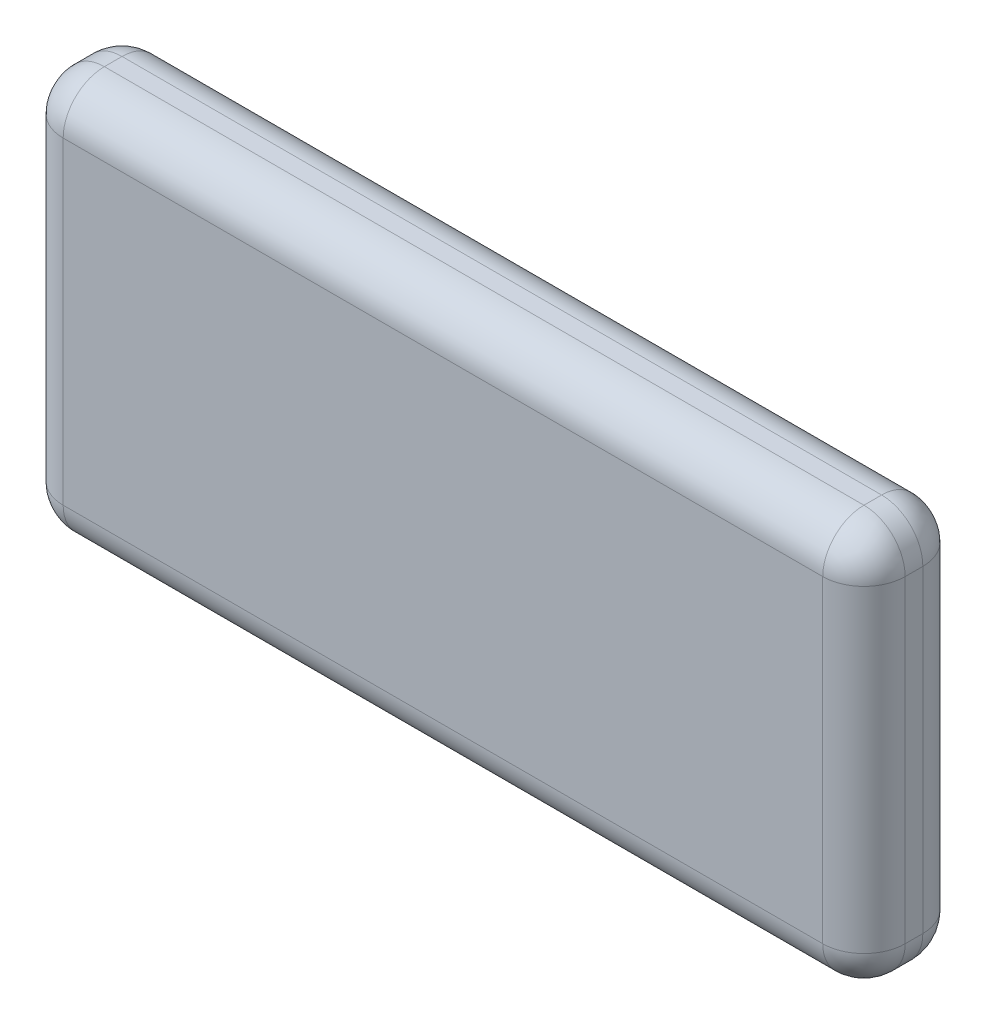
ISO-10303-21;
HEADER;
FILE_DESCRIPTION(('STEP AP214'),'2;1');
FILE_NAME('part.step','',(''),(''),'','','');
FILE_SCHEMA(('AUTOMOTIVE_DESIGN { 1 0 10303 214 1 1 1 1 }'));
ENDSEC;
DATA;
#1=APPLICATION_CONTEXT('core data for automotive mechanical design processes');
#2=APPLICATION_PROTOCOL_DEFINITION('international standard','automotive_design',2000,#1);
#3=PRODUCT_CONTEXT('',#1,'mechanical');
#4=PRODUCT('Part','Part','',(#3));
#5=PRODUCT_RELATED_PRODUCT_CATEGORY('part','',(#4));
#6=PRODUCT_DEFINITION_FORMATION('','',#4);
#7=PRODUCT_DEFINITION_CONTEXT('part definition',#1,'design');
#8=PRODUCT_DEFINITION('design','',#6,#7);
#9=PRODUCT_DEFINITION_SHAPE('','',#8);
#10=(LENGTH_UNIT() NAMED_UNIT(*) SI_UNIT(.MILLI.,.METRE.));
#11=(NAMED_UNIT(*) PLANE_ANGLE_UNIT() SI_UNIT($,.RADIAN.));
#12=(NAMED_UNIT(*) SI_UNIT($,.STERADIAN.) SOLID_ANGLE_UNIT());
#13=UNCERTAINTY_MEASURE_WITH_UNIT(LENGTH_MEASURE(1.E-05),#10,'distance_accuracy_value','');
#14=(GEOMETRIC_REPRESENTATION_CONTEXT(3) GLOBAL_UNCERTAINTY_ASSIGNED_CONTEXT((#13)) GLOBAL_UNIT_ASSIGNED_CONTEXT((#10,
#11,#12)) REPRESENTATION_CONTEXT('',''));
#15=CARTESIAN_POINT('',(0.,0.,0.));
#16=DIRECTION('',(0.,0.,1.));
#17=DIRECTION('',(1.,0.,0.));
#18=AXIS2_PLACEMENT_3D('',#15,#16,#17);
#19=CARTESIAN_POINT('',(-137.203539823009,47.6902654867257,17.));
#20=DIRECTION('',(1.,0.,0.));
#21=DIRECTION('',(0.,0.,-1.));
#22=AXIS2_PLACEMENT_3D('',#19,#20,#21);
#23=PLANE('',#22);
#24=DIRECTION('',(0.,-1.,0.));
#25=VECTOR('',#24,1.);
#26=CARTESIAN_POINT('',(-137.203539823009,47.6902654867257,7.));
#27=LINE('',#26,#25);
#28=CARTESIAN_POINT('',(-137.203539823009,40.6902654867257,7.));
#29=VERTEX_POINT('',#28);
#30=CARTESIAN_POINT('',(-137.203539823009,-13.3097345132743,7.));
#31=VERTEX_POINT('',#30);
#32=EDGE_CURVE('E209',#29,#31,#27,.T.);
#33=ORIENTED_EDGE('',*,*,#32,.T.);
#34=DIRECTION('',(0.,0.,-1.));
#35=VECTOR('',#34,1.);
#36=CARTESIAN_POINT('',(-137.203539823009,-13.3097345132743,17.));
#37=LINE('',#36,#35);
#38=CARTESIAN_POINT('',(-137.203539823009,-13.3097345132743,10.));
#39=VERTEX_POINT('',#38);
#40=EDGE_CURVE('E289',#31,#39,#37,.F.);
#41=ORIENTED_EDGE('',*,*,#40,.T.);
#42=DIRECTION('',(0.,-1.,0.));
#43=VECTOR('',#42,1.);
#44=CARTESIAN_POINT('',(-137.203539823009,47.6902654867257,10.));
#45=LINE('',#44,#43);
#46=CARTESIAN_POINT('',(-137.203539823009,40.6902654867257,10.));
#47=VERTEX_POINT('',#46);
#48=EDGE_CURVE('E216',#39,#47,#45,.F.);
#49=ORIENTED_EDGE('',*,*,#48,.T.);
#50=DIRECTION('',(0.,0.,-1.));
#51=VECTOR('',#50,1.);
#52=CARTESIAN_POINT('',(-137.203539823009,40.6902654867257,17.));
#53=LINE('',#52,#51);
#54=EDGE_CURVE('E213',#47,#29,#53,.T.);
#55=ORIENTED_EDGE('',*,*,#54,.T.);
#56=EDGE_LOOP('',(#33,#41,#49,#55));
#57=FACE_BOUND('',#56,.T.);
#58=ADVANCED_FACE('F47',(#57),#23,.F.);
#59=CARTESIAN_POINT('',(-137.203539823009,-20.3097345132743,17.));
#60=DIRECTION('',(0.,1.,0.));
#61=DIRECTION('',(0.,0.,1.));
#62=AXIS2_PLACEMENT_3D('',#59,#60,#61);
#63=PLANE('',#62);
#64=DIRECTION('',(1.,0.,0.));
#65=VECTOR('',#64,1.);
#66=CARTESIAN_POINT('',(-137.203539823009,-20.3097345132743,10.));
#67=LINE('',#66,#65);
#68=CARTESIAN_POINT('',(-1.20353982300886,-20.3097345132743,10.));
#69=VERTEX_POINT('',#68);
#70=CARTESIAN_POINT('',(-130.203539823009,-20.3097345132743,10.));
#71=VERTEX_POINT('',#70);
#72=EDGE_CURVE('E238',#69,#71,#67,.F.);
#73=ORIENTED_EDGE('',*,*,#72,.T.);
#74=DIRECTION('',(0.,0.,-1.));
#75=VECTOR('',#74,1.);
#76=CARTESIAN_POINT('',(-130.203539823009,-20.3097345132743,17.));
#77=LINE('',#76,#75);
#78=CARTESIAN_POINT('',(-130.203539823009,-20.3097345132743,7.));
#79=VERTEX_POINT('',#78);
#80=EDGE_CURVE('E286',#71,#79,#77,.T.);
#81=ORIENTED_EDGE('',*,*,#80,.T.);
#82=DIRECTION('',(1.,0.,0.));
#83=VECTOR('',#82,1.);
#84=CARTESIAN_POINT('',(-137.203539823009,-20.3097345132743,7.));
#85=LINE('',#84,#83);
#86=CARTESIAN_POINT('',(-1.20353982300886,-20.3097345132743,7.));
#87=VERTEX_POINT('',#86);
#88=EDGE_CURVE('E234',#79,#87,#85,.T.);
#89=ORIENTED_EDGE('',*,*,#88,.T.);
#90=DIRECTION('',(0.,0.,-1.));
#91=VECTOR('',#90,1.);
#92=CARTESIAN_POINT('',(-1.20353982300886,-20.3097345132743,17.));
#93=LINE('',#92,#91);
#94=EDGE_CURVE('E283',#87,#69,#93,.F.);
#95=ORIENTED_EDGE('',*,*,#94,.T.);
#96=EDGE_LOOP('',(#73,#81,#89,#95));
#97=FACE_BOUND('',#96,.T.);
#98=ADVANCED_FACE('F357',(#97),#63,.F.);
#99=CARTESIAN_POINT('',(5.79646017699115,47.6902654867257,17.));
#100=DIRECTION('',(-1.,0.,0.));
#101=DIRECTION('',(0.,0.,1.));
#102=AXIS2_PLACEMENT_3D('',#99,#100,#101);
#103=PLANE('',#102);
#104=DIRECTION('',(0.,1.,0.));
#105=VECTOR('',#104,1.);
#106=CARTESIAN_POINT('',(5.79646017699115,-20.3097345132743,10.));
#107=LINE('',#106,#105);
#108=CARTESIAN_POINT('',(5.79646017699115,40.6902654867257,10.));
#109=VERTEX_POINT('',#108);
#110=CARTESIAN_POINT('',(5.79646017699115,-13.3097345132743,10.));
#111=VERTEX_POINT('',#110);
#112=EDGE_CURVE('E191',#109,#111,#107,.F.);
#113=ORIENTED_EDGE('',*,*,#112,.T.);
#114=DIRECTION('',(0.,0.,-1.));
#115=VECTOR('',#114,1.);
#116=CARTESIAN_POINT('',(5.79646017699115,-13.3097345132743,17.));
#117=LINE('',#116,#115);
#118=CARTESIAN_POINT('',(5.79646017699115,-13.3097345132743,7.));
#119=VERTEX_POINT('',#118);
#120=EDGE_CURVE('E65',#111,#119,#117,.T.);
#121=ORIENTED_EDGE('',*,*,#120,.T.);
#122=DIRECTION('',(0.,1.,0.));
#123=VECTOR('',#122,1.);
#124=CARTESIAN_POINT('',(5.79646017699115,47.6902654867257,7.));
#125=LINE('',#124,#123);
#126=CARTESIAN_POINT('',(5.79646017699115,40.6902654867257,7.));
#127=VERTEX_POINT('',#126);
#128=EDGE_CURVE('E181',#119,#127,#125,.T.);
#129=ORIENTED_EDGE('',*,*,#128,.T.);
#130=DIRECTION('',(0.,0.,-1.));
#131=VECTOR('',#130,1.);
#132=CARTESIAN_POINT('',(5.79646017699115,40.6902654867257,17.));
#133=LINE('',#132,#131);
#134=EDGE_CURVE('E147',#127,#109,#133,.F.);
#135=ORIENTED_EDGE('',*,*,#134,.T.);
#136=EDGE_LOOP('',(#113,#121,#129,#135));
#137=FACE_BOUND('',#136,.T.);
#138=ADVANCED_FACE('F359',(#137),#103,.F.);
#139=CARTESIAN_POINT('',(-137.203539823009,47.6902654867257,17.));
#140=DIRECTION('',(0.,-1.,0.));
#141=DIRECTION('',(1.,0.,0.));
#142=AXIS2_PLACEMENT_3D('',#139,#140,#141);
#143=PLANE('',#142);
#144=DIRECTION('',(-1.,0.,0.));
#145=VECTOR('',#144,1.);
#146=CARTESIAN_POINT('',(5.79646017699115,47.6902654867257,10.));
#147=LINE('',#146,#145);
#148=CARTESIAN_POINT('',(-130.203539823009,47.6902654867257,10.));
#149=VERTEX_POINT('',#148);
#150=CARTESIAN_POINT('',(-1.20353982300886,47.6902654867257,10.));
#151=VERTEX_POINT('',#150);
#152=EDGE_CURVE('E178',#149,#151,#147,.F.);
#153=ORIENTED_EDGE('',*,*,#152,.T.);
#154=DIRECTION('',(0.,0.,-1.));
#155=VECTOR('',#154,1.);
#156=CARTESIAN_POINT('',(-1.20353982300886,47.6902654867257,17.));
#157=LINE('',#156,#155);
#158=CARTESIAN_POINT('',(-1.20353982300886,47.6902654867257,7.));
#159=VERTEX_POINT('',#158);
#160=EDGE_CURVE('E145',#151,#159,#157,.T.);
#161=ORIENTED_EDGE('',*,*,#160,.T.);
#162=DIRECTION('',(-1.,0.,0.));
#163=VECTOR('',#162,1.);
#164=CARTESIAN_POINT('',(-137.203539823009,47.6902654867257,7.));
#165=LINE('',#164,#163);
#166=CARTESIAN_POINT('',(-130.203539823009,47.6902654867257,7.));
#167=VERTEX_POINT('',#166);
#168=EDGE_CURVE('E166',#159,#167,#165,.T.);
#169=ORIENTED_EDGE('',*,*,#168,.T.);
#170=DIRECTION('',(0.,0.,-1.));
#171=VECTOR('',#170,1.);
#172=CARTESIAN_POINT('',(-130.203539823009,47.6902654867257,17.));
#173=LINE('',#172,#171);
#174=EDGE_CURVE('E173',#167,#149,#173,.F.);
#175=ORIENTED_EDGE('',*,*,#174,.T.);
#176=EDGE_LOOP('',(#153,#161,#169,#175));
#177=FACE_BOUND('',#176,.T.);
#178=ADVANCED_FACE('F176',(#177),#143,.F.);
#179=CARTESIAN_POINT('',(0.,0.,17.));
#180=DIRECTION('',(0.,0.,1.));
#181=DIRECTION('',(1.,0.,0.));
#182=AXIS2_PLACEMENT_3D('',#179,#180,#181);
#183=PLANE('',#182);
#184=DIRECTION('',(0.,1.,0.));
#185=VECTOR('',#184,1.);
#186=CARTESIAN_POINT('',(-1.20353982300885,47.6902654867257,17.));
#187=LINE('',#186,#185);
#188=CARTESIAN_POINT('',(-1.20353982300885,-13.3097345132743,17.));
#189=VERTEX_POINT('',#188);
#190=CARTESIAN_POINT('',(-1.20353982300885,40.6902654867257,17.));
#191=VERTEX_POINT('',#190);
#192=EDGE_CURVE('E202',#189,#191,#187,.T.);
#193=ORIENTED_EDGE('',*,*,#192,.T.);
#194=DIRECTION('',(-1.,0.,0.));
#195=VECTOR('',#194,1.);
#196=CARTESIAN_POINT('',(-137.203539823009,40.6902654867257,17.));
#197=LINE('',#196,#195);
#198=CARTESIAN_POINT('',(-130.203539823009,40.6902654867257,17.));
#199=VERTEX_POINT('',#198);
#200=EDGE_CURVE('E205',#191,#199,#197,.T.);
#201=ORIENTED_EDGE('',*,*,#200,.T.);
#202=DIRECTION('',(0.,-1.,0.));
#203=VECTOR('',#202,1.);
#204=CARTESIAN_POINT('',(-130.203539823009,-20.3097345132743,17.));
#205=LINE('',#204,#203);
#206=CARTESIAN_POINT('',(-130.203539823009,-13.3097345132743,17.));
#207=VERTEX_POINT('',#206);
#208=EDGE_CURVE('E198',#199,#207,#205,.T.);
#209=ORIENTED_EDGE('',*,*,#208,.T.);
#210=DIRECTION('',(1.,0.,0.));
#211=VECTOR('',#210,1.);
#212=CARTESIAN_POINT('',(5.79646017699115,-13.3097345132743,17.));
#213=LINE('',#212,#211);
#214=EDGE_CURVE('E194',#207,#189,#213,.T.);
#215=ORIENTED_EDGE('',*,*,#214,.T.);
#216=EDGE_LOOP('',(#193,#201,#209,#215));
#217=FACE_BOUND('',#216,.T.);
#218=ADVANCED_FACE('F484',(#217),#183,.T.);
#219=CARTESIAN_POINT('',(0.,0.,0.));
#220=DIRECTION('',(0.,0.,1.));
#221=DIRECTION('',(1.,0.,0.));
#222=AXIS2_PLACEMENT_3D('',#219,#220,#221);
#223=PLANE('',#222);
#224=DIRECTION('',(0.,-1.,0.));
#225=VECTOR('',#224,1.);
#226=CARTESIAN_POINT('',(-130.203539823009,0.,0.));
#227=LINE('',#226,#225);
#228=CARTESIAN_POINT('',(-130.203539823009,-13.3097345132743,0.));
#229=VERTEX_POINT('',#228);
#230=CARTESIAN_POINT('',(-130.203539823009,40.6902654867257,0.));
#231=VERTEX_POINT('',#230);
#232=EDGE_CURVE('E223',#229,#231,#227,.F.);
#233=ORIENTED_EDGE('',*,*,#232,.T.);
#234=DIRECTION('',(-1.,0.,0.));
#235=VECTOR('',#234,1.);
#236=CARTESIAN_POINT('',(0.,40.6902654867257,0.));
#237=LINE('',#236,#235);
#238=CARTESIAN_POINT('',(-1.20353982300885,40.6902654867257,0.));
#239=VERTEX_POINT('',#238);
#240=EDGE_CURVE('E230',#231,#239,#237,.F.);
#241=ORIENTED_EDGE('',*,*,#240,.T.);
#242=DIRECTION('',(0.,1.,0.));
#243=VECTOR('',#242,1.);
#244=CARTESIAN_POINT('',(-1.20353982300885,0.,0.));
#245=LINE('',#244,#243);
#246=CARTESIAN_POINT('',(-1.20353982300885,-13.3097345132743,0.));
#247=VERTEX_POINT('',#246);
#248=EDGE_CURVE('E226',#239,#247,#245,.F.);
#249=ORIENTED_EDGE('',*,*,#248,.T.);
#250=DIRECTION('',(1.,0.,0.));
#251=VECTOR('',#250,1.);
#252=CARTESIAN_POINT('',(0.,-13.3097345132743,0.));
#253=LINE('',#252,#251);
#254=EDGE_CURVE('E219',#247,#229,#253,.F.);
#255=ORIENTED_EDGE('',*,*,#254,.T.);
#256=EDGE_LOOP('',(#233,#241,#249,#255));
#257=FACE_BOUND('',#256,.T.);
#258=ADVANCED_FACE('F325',(#257),#223,.F.);
#259=CARTESIAN_POINT('',(-130.203539823009,0.,10.));
#260=DIRECTION('',(0.,1.,0.));
#261=DIRECTION('',(0.,0.,1.));
#262=AXIS2_PLACEMENT_3D('',#259,#260,#261);
#263=CYLINDRICAL_SURFACE('',#262,7.);
#264=ORIENTED_EDGE('',*,*,#48,.F.);
#265=CARTESIAN_POINT('',(-130.203539823009,-13.3097345132743,10.));
#266=DIRECTION('',(0.,1.,0.));
#267=DIRECTION('',(0.,0.,1.));
#268=AXIS2_PLACEMENT_3D('',#265,#266,#267);
#269=CIRCLE('',#268,7.);
#270=EDGE_CURVE('E280',#39,#207,#269,.T.);
#271=ORIENTED_EDGE('',*,*,#270,.T.);
#272=ORIENTED_EDGE('',*,*,#208,.F.);
#273=CARTESIAN_POINT('',(-130.203539823009,40.6902654867257,10.));
#274=DIRECTION('',(0.,1.,0.));
#275=DIRECTION('',(0.,0.,1.));
#276=AXIS2_PLACEMENT_3D('',#273,#274,#275);
#277=CIRCLE('',#276,7.);
#278=EDGE_CURVE('E174',#47,#199,#277,.T.);
#279=ORIENTED_EDGE('',*,*,#278,.F.);
#280=EDGE_LOOP('',(#264,#271,#272,#279));
#281=FACE_BOUND('',#280,.T.);
#282=ADVANCED_FACE('F347',(#281),#263,.T.);
#283=CARTESIAN_POINT('',(-130.203539823009,40.6902654867257,17.));
#284=DIRECTION('',(0.,0.,-1.));
#285=DIRECTION('',(-1.,0.,0.));
#286=AXIS2_PLACEMENT_3D('',#283,#284,#285);
#287=CYLINDRICAL_SURFACE('',#286,7.);
#288=CARTESIAN_POINT('',(-130.203539823009,40.6902654867257,7.));
#289=DIRECTION('',(0.,0.,-1.));
#290=DIRECTION('',(-1.,0.,0.));
#291=AXIS2_PLACEMENT_3D('',#288,#289,#290);
#292=CIRCLE('',#291,7.);
#293=EDGE_CURVE('E263',#29,#167,#292,.T.);
#294=ORIENTED_EDGE('',*,*,#293,.F.);
#295=ORIENTED_EDGE('',*,*,#54,.F.);
#296=CARTESIAN_POINT('',(-130.203539823009,40.6902654867257,10.));
#297=DIRECTION('',(0.,0.,1.));
#298=DIRECTION('',(1.,0.,0.));
#299=AXIS2_PLACEMENT_3D('',#296,#297,#298);
#300=CIRCLE('',#299,7.);
#301=EDGE_CURVE('E267',#149,#47,#300,.T.);
#302=ORIENTED_EDGE('',*,*,#301,.F.);
#303=ORIENTED_EDGE('',*,*,#174,.F.);
#304=EDGE_LOOP('',(#294,#295,#302,#303));
#305=FACE_BOUND('',#304,.T.);
#306=ADVANCED_FACE('F404',(#305),#287,.T.);
#307=CARTESIAN_POINT('',(-130.203539823009,47.6902654867257,7.));
#308=DIRECTION('',(0.,-1.,0.));
#309=DIRECTION('',(0.,0.,-1.));
#310=AXIS2_PLACEMENT_3D('',#307,#308,#309);
#311=CYLINDRICAL_SURFACE('',#310,7.);
#312=ORIENTED_EDGE('',*,*,#232,.F.);
#313=CARTESIAN_POINT('',(-130.203539823009,-13.3097345132743,7.));
#314=DIRECTION('',(0.,-1.,0.));
#315=DIRECTION('',(0.,0.,-1.));
#316=AXIS2_PLACEMENT_3D('',#313,#314,#315);
#317=CIRCLE('',#316,7.);
#318=EDGE_CURVE('E57',#229,#31,#317,.F.);
#319=ORIENTED_EDGE('',*,*,#318,.T.);
#320=ORIENTED_EDGE('',*,*,#32,.F.);
#321=CARTESIAN_POINT('',(-130.203539823009,40.6902654867257,7.));
#322=DIRECTION('',(0.,1.,0.));
#323=DIRECTION('',(0.,0.,1.));
#324=AXIS2_PLACEMENT_3D('',#321,#322,#323);
#325=CIRCLE('',#324,7.);
#326=EDGE_CURVE('E259',#231,#29,#325,.T.);
#327=ORIENTED_EDGE('',*,*,#326,.F.);
#328=EDGE_LOOP('',(#312,#319,#320,#327));
#329=FACE_BOUND('',#328,.T.);
#330=ADVANCED_FACE('F401',(#329),#311,.T.);
#331=CARTESIAN_POINT('',(0.,-13.3097345132743,10.));
#332=DIRECTION('',(-1.,0.,0.));
#333=DIRECTION('',(0.,0.,1.));
#334=AXIS2_PLACEMENT_3D('',#331,#332,#333);
#335=CYLINDRICAL_SURFACE('',#334,7.);
#336=ORIENTED_EDGE('',*,*,#214,.F.);
#337=CARTESIAN_POINT('',(-130.203539823009,-13.3097345132743,10.));
#338=DIRECTION('',(-1.,0.,0.));
#339=DIRECTION('',(0.,0.,1.));
#340=AXIS2_PLACEMENT_3D('',#337,#338,#339);
#341=CIRCLE('',#340,7.);
#342=EDGE_CURVE('E276',#207,#71,#341,.F.);
#343=ORIENTED_EDGE('',*,*,#342,.T.);
#344=ORIENTED_EDGE('',*,*,#72,.F.);
#345=CARTESIAN_POINT('',(-1.20353982300885,-13.3097345132743,10.));
#346=DIRECTION('',(-1.,0.,0.));
#347=DIRECTION('',(0.,0.,1.));
#348=AXIS2_PLACEMENT_3D('',#345,#346,#347);
#349=CIRCLE('',#348,7.);
#350=EDGE_CURVE('E241',#69,#189,#349,.T.);
#351=ORIENTED_EDGE('',*,*,#350,.T.);
#352=EDGE_LOOP('',(#336,#343,#344,#351));
#353=FACE_BOUND('',#352,.T.);
#354=ADVANCED_FACE('F355',(#353),#335,.T.);
#355=CARTESIAN_POINT('',(-130.203539823009,40.6902654867257,10.));
#356=DIRECTION('',(-1.,0.,0.));
#357=DIRECTION('',(0.,0.,1.));
#358=AXIS2_PLACEMENT_3D('',#355,#356,#357);
#359=SPHERICAL_SURFACE('',#358,7.);
#360=ORIENTED_EDGE('',*,*,#301,.T.);
#361=ORIENTED_EDGE('',*,*,#278,.T.);
#362=CARTESIAN_POINT('',(-130.203539823009,40.6902654867257,10.));
#363=DIRECTION('',(-1.,0.,0.));
#364=DIRECTION('',(0.,0.,1.));
#365=AXIS2_PLACEMENT_3D('',#362,#363,#364);
#366=CIRCLE('',#365,7.);
#367=EDGE_CURVE('E256',#149,#199,#366,.F.);
#368=ORIENTED_EDGE('',*,*,#367,.F.);
#369=EDGE_LOOP('',(#360,#361,#368));
#370=FACE_BOUND('',#369,.T.);
#371=ADVANCED_FACE('F394',(#370),#359,.T.);
#372=CARTESIAN_POINT('',(-130.203539823009,40.6902654867257,7.));
#373=DIRECTION('',(-1.,0.,0.));
#374=DIRECTION('',(0.,0.,1.));
#375=AXIS2_PLACEMENT_3D('',#372,#373,#374);
#376=SPHERICAL_SURFACE('',#375,7.);
#377=ORIENTED_EDGE('',*,*,#326,.T.);
#378=ORIENTED_EDGE('',*,*,#293,.T.);
#379=CARTESIAN_POINT('',(-130.203539823009,40.6902654867257,7.));
#380=DIRECTION('',(-1.,0.,0.));
#381=DIRECTION('',(0.,0.,1.));
#382=AXIS2_PLACEMENT_3D('',#379,#380,#381);
#383=CIRCLE('',#382,7.);
#384=EDGE_CURVE('E169',#231,#167,#383,.F.);
#385=ORIENTED_EDGE('',*,*,#384,.F.);
#386=EDGE_LOOP('',(#377,#378,#385));
#387=FACE_BOUND('',#386,.T.);
#388=ADVANCED_FACE('F391',(#387),#376,.T.);
#389=CARTESIAN_POINT('',(-137.203539823009,-13.3097345132743,7.));
#390=DIRECTION('',(1.,0.,0.));
#391=DIRECTION('',(0.,0.,-1.));
#392=AXIS2_PLACEMENT_3D('',#389,#390,#391);
#393=CYLINDRICAL_SURFACE('',#392,7.);
#394=ORIENTED_EDGE('',*,*,#88,.F.);
#395=CARTESIAN_POINT('',(-130.203539823009,-13.3097345132743,7.));
#396=DIRECTION('',(1.,0.,0.));
#397=DIRECTION('',(0.,0.,-1.));
#398=AXIS2_PLACEMENT_3D('',#395,#396,#397);
#399=CIRCLE('',#398,7.);
#400=EDGE_CURVE('E301',#79,#229,#399,.T.);
#401=ORIENTED_EDGE('',*,*,#400,.T.);
#402=ORIENTED_EDGE('',*,*,#254,.F.);
#403=CARTESIAN_POINT('',(-1.20353982300886,-13.3097345132743,7.));
#404=DIRECTION('',(1.,0.,0.));
#405=DIRECTION('',(0.,0.,-1.));
#406=AXIS2_PLACEMENT_3D('',#403,#404,#405);
#407=CIRCLE('',#406,7.);
#408=EDGE_CURVE('E298',#247,#87,#407,.F.);
#409=ORIENTED_EDGE('',*,*,#408,.T.);
#410=EDGE_LOOP('',(#394,#401,#402,#409));
#411=FACE_BOUND('',#410,.T.);
#412=ADVANCED_FACE('F329',(#411),#393,.T.);
#413=CARTESIAN_POINT('',(-1.20353982300885,0.,10.));
#414=DIRECTION('',(0.,-1.,0.));
#415=DIRECTION('',(0.,0.,-1.));
#416=AXIS2_PLACEMENT_3D('',#413,#414,#415);
#417=CYLINDRICAL_SURFACE('',#416,7.);
#418=ORIENTED_EDGE('',*,*,#192,.F.);
#419=CARTESIAN_POINT('',(-1.20353982300885,-13.3097345132743,10.));
#420=DIRECTION('',(0.,-1.,0.));
#421=DIRECTION('',(0.,0.,-1.));
#422=AXIS2_PLACEMENT_3D('',#419,#420,#421);
#423=CIRCLE('',#422,7.);
#424=EDGE_CURVE('E292',#189,#111,#423,.F.);
#425=ORIENTED_EDGE('',*,*,#424,.T.);
#426=ORIENTED_EDGE('',*,*,#112,.F.);
#427=CARTESIAN_POINT('',(-1.20353982300885,40.6902654867257,10.));
#428=DIRECTION('',(0.,1.,0.));
#429=DIRECTION('',(0.,0.,1.));
#430=AXIS2_PLACEMENT_3D('',#427,#428,#429);
#431=CIRCLE('',#430,7.);
#432=EDGE_CURVE('E250',#191,#109,#431,.T.);
#433=ORIENTED_EDGE('',*,*,#432,.F.);
#434=EDGE_LOOP('',(#418,#425,#426,#433));
#435=FACE_BOUND('',#434,.T.);
#436=ADVANCED_FACE('F384',(#435),#417,.T.);
#437=CARTESIAN_POINT('',(0.,40.6902654867257,10.));
#438=DIRECTION('',(1.,0.,0.));
#439=DIRECTION('',(0.,1.,0.));
#440=AXIS2_PLACEMENT_3D('',#437,#438,#439);
#441=CYLINDRICAL_SURFACE('',#440,7.);
#442=ORIENTED_EDGE('',*,*,#367,.T.);
#443=ORIENTED_EDGE('',*,*,#200,.F.);
#444=CARTESIAN_POINT('',(-1.20353982300886,40.6902654867257,10.));
#445=DIRECTION('',(1.,0.,0.));
#446=DIRECTION('',(0.,0.,-1.));
#447=AXIS2_PLACEMENT_3D('',#444,#445,#446);
#448=CIRCLE('',#447,7.);
#449=EDGE_CURVE('E163',#151,#191,#448,.T.);
#450=ORIENTED_EDGE('',*,*,#449,.F.);
#451=ORIENTED_EDGE('',*,*,#152,.F.);
#452=EDGE_LOOP('',(#442,#443,#450,#451));
#453=FACE_BOUND('',#452,.T.);
#454=ADVANCED_FACE('F381',(#453),#441,.T.);
#455=CARTESIAN_POINT('',(-137.203539823009,40.6902654867257,7.));
#456=DIRECTION('',(-1.,0.,0.));
#457=DIRECTION('',(0.,-1.,0.));
#458=AXIS2_PLACEMENT_3D('',#455,#456,#457);
#459=CYLINDRICAL_SURFACE('',#458,7.);
#460=ORIENTED_EDGE('',*,*,#384,.T.);
#461=ORIENTED_EDGE('',*,*,#168,.F.);
#462=CARTESIAN_POINT('',(-1.20353982300885,40.6902654867257,7.));
#463=DIRECTION('',(1.,0.,0.));
#464=DIRECTION('',(0.,1.,0.));
#465=AXIS2_PLACEMENT_3D('',#462,#463,#464);
#466=CIRCLE('',#465,7.);
#467=EDGE_CURVE('E154',#239,#159,#466,.T.);
#468=ORIENTED_EDGE('',*,*,#467,.F.);
#469=ORIENTED_EDGE('',*,*,#240,.F.);
#470=EDGE_LOOP('',(#460,#461,#468,#469));
#471=FACE_BOUND('',#470,.T.);
#472=ADVANCED_FACE('F167',(#471),#459,.T.);
#473=CARTESIAN_POINT('',(-1.20353982300885,47.6902654867257,7.));
#474=DIRECTION('',(0.,1.,0.));
#475=DIRECTION('',(0.,0.,1.));
#476=AXIS2_PLACEMENT_3D('',#473,#474,#475);
#477=CYLINDRICAL_SURFACE('',#476,7.);
#478=ORIENTED_EDGE('',*,*,#128,.F.);
#479=CARTESIAN_POINT('',(-1.20353982300885,-13.3097345132743,7.));
#480=DIRECTION('',(0.,1.,0.));
#481=DIRECTION('',(0.,0.,1.));
#482=AXIS2_PLACEMENT_3D('',#479,#480,#481);
#483=CIRCLE('',#482,7.);
#484=EDGE_CURVE('E11',#119,#247,#483,.T.);
#485=ORIENTED_EDGE('',*,*,#484,.T.);
#486=ORIENTED_EDGE('',*,*,#248,.F.);
#487=CARTESIAN_POINT('',(-1.20353982300885,40.6902654867257,7.));
#488=DIRECTION('',(0.,1.,0.));
#489=DIRECTION('',(0.,0.,1.));
#490=AXIS2_PLACEMENT_3D('',#487,#488,#489);
#491=CIRCLE('',#490,7.);
#492=EDGE_CURVE('E158',#127,#239,#491,.T.);
#493=ORIENTED_EDGE('',*,*,#492,.F.);
#494=EDGE_LOOP('',(#478,#485,#486,#493));
#495=FACE_BOUND('',#494,.T.);
#496=ADVANCED_FACE('F322',(#495),#477,.T.);
#497=CARTESIAN_POINT('',(-1.20353982300885,40.6902654867257,10.));
#498=DIRECTION('',(0.,0.,1.));
#499=DIRECTION('',(1.,0.,0.));
#500=AXIS2_PLACEMENT_3D('',#497,#498,#499);
#501=SPHERICAL_SURFACE('',#500,7.);
#502=ORIENTED_EDGE('',*,*,#449,.T.);
#503=ORIENTED_EDGE('',*,*,#432,.T.);
#504=CARTESIAN_POINT('',(-1.20353982300885,40.6902654867257,10.));
#505=DIRECTION('',(0.,0.,1.));
#506=DIRECTION('',(1.,0.,0.));
#507=AXIS2_PLACEMENT_3D('',#504,#505,#506);
#508=CIRCLE('',#507,7.);
#509=EDGE_CURVE('E150',#151,#109,#508,.F.);
#510=ORIENTED_EDGE('',*,*,#509,.F.);
#511=EDGE_LOOP('',(#502,#503,#510));
#512=FACE_BOUND('',#511,.T.);
#513=ADVANCED_FACE('F373',(#512),#501,.T.);
#514=CARTESIAN_POINT('',(-1.20353982300885,40.6902654867257,7.));
#515=DIRECTION('',(0.,0.,-1.));
#516=DIRECTION('',(-1.,0.,0.));
#517=AXIS2_PLACEMENT_3D('',#514,#515,#516);
#518=SPHERICAL_SURFACE('',#517,7.);
#519=ORIENTED_EDGE('',*,*,#492,.T.);
#520=ORIENTED_EDGE('',*,*,#467,.T.);
#521=CARTESIAN_POINT('',(-1.20353982300886,40.6902654867257,7.));
#522=DIRECTION('',(0.,0.,-1.));
#523=DIRECTION('',(-1.,0.,0.));
#524=AXIS2_PLACEMENT_3D('',#521,#522,#523);
#525=CIRCLE('',#524,7.);
#526=EDGE_CURVE('E141',#127,#159,#525,.F.);
#527=ORIENTED_EDGE('',*,*,#526,.F.);
#528=EDGE_LOOP('',(#519,#520,#527));
#529=FACE_BOUND('',#528,.T.);
#530=ADVANCED_FACE('F156',(#529),#518,.T.);
#531=CARTESIAN_POINT('',(-1.20353982300886,40.6902654867257,17.));
#532=DIRECTION('',(0.,0.,-1.));
#533=DIRECTION('',(-1.,0.,0.));
#534=AXIS2_PLACEMENT_3D('',#531,#532,#533);
#535=CYLINDRICAL_SURFACE('',#534,7.);
#536=ORIENTED_EDGE('',*,*,#509,.T.);
#537=ORIENTED_EDGE('',*,*,#134,.F.);
#538=ORIENTED_EDGE('',*,*,#526,.T.);
#539=ORIENTED_EDGE('',*,*,#160,.F.);
#540=EDGE_LOOP('',(#536,#537,#538,#539));
#541=FACE_BOUND('',#540,.T.);
#542=ADVANCED_FACE('F143',(#541),#535,.T.);
#543=CARTESIAN_POINT('',(-130.203539823009,-13.3097345132743,7.));
#544=DIRECTION('',(0.,0.,1.));
#545=DIRECTION('',(1.,0.,0.));
#546=AXIS2_PLACEMENT_3D('',#543,#544,#545);
#547=SPHERICAL_SURFACE('',#546,7.);
#548=ORIENTED_EDGE('',*,*,#318,.F.);
#549=ORIENTED_EDGE('',*,*,#400,.F.);
#550=CARTESIAN_POINT('',(-130.203539823009,-13.3097345132743,7.));
#551=DIRECTION('',(0.,0.,1.));
#552=DIRECTION('',(1.,0.,0.));
#553=AXIS2_PLACEMENT_3D('',#550,#551,#552);
#554=CIRCLE('',#553,7.);
#555=EDGE_CURVE('E151',#31,#79,#554,.T.);
#556=ORIENTED_EDGE('',*,*,#555,.F.);
#557=EDGE_LOOP('',(#548,#549,#556));
#558=FACE_BOUND('',#557,.T.);
#559=ADVANCED_FACE('F334',(#558),#547,.T.);
#560=CARTESIAN_POINT('',(-130.203539823009,-13.3097345132743,17.));
#561=DIRECTION('',(0.,0.,-1.));
#562=DIRECTION('',(-1.,0.,0.));
#563=AXIS2_PLACEMENT_3D('',#560,#561,#562);
#564=CYLINDRICAL_SURFACE('',#563,7.);
#565=ORIENTED_EDGE('',*,*,#555,.T.);
#566=ORIENTED_EDGE('',*,*,#80,.F.);
#567=CARTESIAN_POINT('',(-130.203539823009,-13.3097345132743,10.));
#568=DIRECTION('',(0.,0.,1.));
#569=DIRECTION('',(1.,0.,0.));
#570=AXIS2_PLACEMENT_3D('',#567,#568,#569);
#571=CIRCLE('',#570,7.);
#572=EDGE_CURVE('E306',#39,#71,#571,.T.);
#573=ORIENTED_EDGE('',*,*,#572,.F.);
#574=ORIENTED_EDGE('',*,*,#40,.F.);
#575=EDGE_LOOP('',(#565,#566,#573,#574));
#576=FACE_BOUND('',#575,.T.);
#577=ADVANCED_FACE('F338',(#576),#564,.T.);
#578=CARTESIAN_POINT('',(-130.203539823009,-13.3097345132743,10.));
#579=DIRECTION('',(0.,0.,1.));
#580=DIRECTION('',(1.,0.,0.));
#581=AXIS2_PLACEMENT_3D('',#578,#579,#580);
#582=SPHERICAL_SURFACE('',#581,7.);
#583=ORIENTED_EDGE('',*,*,#342,.F.);
#584=ORIENTED_EDGE('',*,*,#270,.F.);
#585=ORIENTED_EDGE('',*,*,#572,.T.);
#586=EDGE_LOOP('',(#583,#584,#585));
#587=FACE_BOUND('',#586,.T.);
#588=ADVANCED_FACE('F351',(#587),#582,.T.);
#589=CARTESIAN_POINT('',(-1.20353982300886,-13.3097345132743,7.));
#590=DIRECTION('',(0.,0.,1.));
#591=DIRECTION('',(1.,0.,0.));
#592=AXIS2_PLACEMENT_3D('',#589,#590,#591);
#593=SPHERICAL_SURFACE('',#592,7.);
#594=ORIENTED_EDGE('',*,*,#408,.F.);
#595=ORIENTED_EDGE('',*,*,#484,.F.);
#596=CARTESIAN_POINT('',(-1.20353982300886,-13.3097345132743,7.));
#597=DIRECTION('',(0.,0.,1.));
#598=DIRECTION('',(1.,0.,0.));
#599=AXIS2_PLACEMENT_3D('',#596,#597,#598);
#600=CIRCLE('',#599,7.);
#601=EDGE_CURVE('E51',#87,#119,#600,.T.);
#602=ORIENTED_EDGE('',*,*,#601,.F.);
#603=EDGE_LOOP('',(#594,#595,#602));
#604=FACE_BOUND('',#603,.T.);
#605=ADVANCED_FACE('F49',(#604),#593,.T.);
#606=CARTESIAN_POINT('',(-1.20353982300885,-13.3097345132743,17.));
#607=DIRECTION('',(0.,0.,-1.));
#608=DIRECTION('',(-1.,0.,0.));
#609=AXIS2_PLACEMENT_3D('',#606,#607,#608);
#610=CYLINDRICAL_SURFACE('',#609,7.);
#611=ORIENTED_EDGE('',*,*,#601,.T.);
#612=ORIENTED_EDGE('',*,*,#120,.F.);
#613=CARTESIAN_POINT('',(-1.20353982300885,-13.3097345132743,10.));
#614=DIRECTION('',(0.,0.,1.));
#615=DIRECTION('',(1.,0.,0.));
#616=AXIS2_PLACEMENT_3D('',#613,#614,#615);
#617=CIRCLE('',#616,7.);
#618=EDGE_CURVE('E73',#69,#111,#617,.T.);
#619=ORIENTED_EDGE('',*,*,#618,.F.);
#620=ORIENTED_EDGE('',*,*,#94,.F.);
#621=EDGE_LOOP('',(#611,#612,#619,#620));
#622=FACE_BOUND('',#621,.T.);
#623=ADVANCED_FACE('F317',(#622),#610,.T.);
#624=CARTESIAN_POINT('',(-1.20353982300885,-13.3097345132743,10.));
#625=DIRECTION('',(0.,0.,1.));
#626=DIRECTION('',(1.,0.,0.));
#627=AXIS2_PLACEMENT_3D('',#624,#625,#626);
#628=SPHERICAL_SURFACE('',#627,7.);
#629=ORIENTED_EDGE('',*,*,#424,.F.);
#630=ORIENTED_EDGE('',*,*,#350,.F.);
#631=ORIENTED_EDGE('',*,*,#618,.T.);
#632=EDGE_LOOP('',(#629,#630,#631));
#633=FACE_BOUND('',#632,.T.);
#634=ADVANCED_FACE('F417',(#633),#628,.T.);
#635=CLOSED_SHELL('',(#58,#98,#138,#178,#218,#258,#282,#306,#330,#354,#371,#388,#412,#436,#454,
#472,#496,#513,#530,#542,#559,#577,#588,#605,#623,#634));
#636=MANIFOLD_SOLID_BREP('B2',#635);
#637=ADVANCED_BREP_SHAPE_REPRESENTATION('',(#18,#636),#14);
#638=SHAPE_DEFINITION_REPRESENTATION(#9,#637);
ENDSEC;
END-ISO-10303-21;
